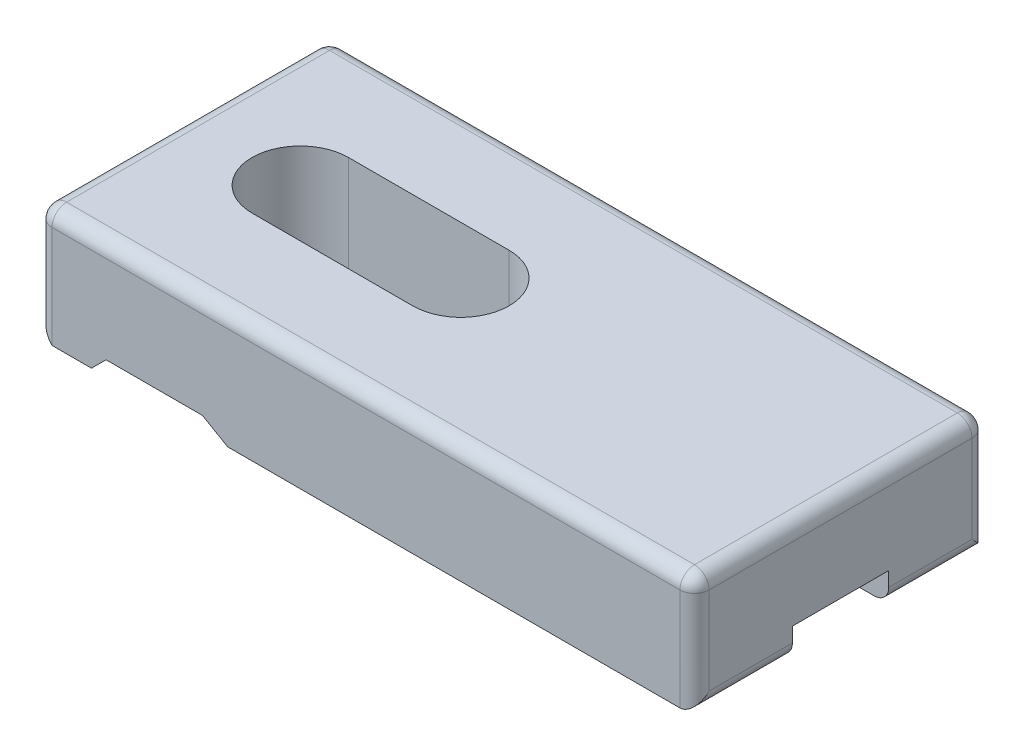
ISO-10303-21;
HEADER;
FILE_DESCRIPTION(('STEP AP214'),'2;1');
FILE_NAME('part.step','',(''),(''),'','','');
FILE_SCHEMA(('AUTOMOTIVE_DESIGN { 1 0 10303 214 1 1 1 1 }'));
ENDSEC;
DATA;
#1=APPLICATION_CONTEXT('core data for automotive mechanical design processes');
#2=APPLICATION_PROTOCOL_DEFINITION('international standard','automotive_design',2000,#1);
#3=PRODUCT_CONTEXT('',#1,'mechanical');
#4=PRODUCT('Part','Part','',(#3));
#5=PRODUCT_RELATED_PRODUCT_CATEGORY('part','',(#4));
#6=PRODUCT_DEFINITION_FORMATION('','',#4);
#7=PRODUCT_DEFINITION_CONTEXT('part definition',#1,'design');
#8=PRODUCT_DEFINITION('design','',#6,#7);
#9=PRODUCT_DEFINITION_SHAPE('','',#8);
#10=(LENGTH_UNIT() NAMED_UNIT(*) SI_UNIT(.MILLI.,.METRE.));
#11=(NAMED_UNIT(*) PLANE_ANGLE_UNIT() SI_UNIT($,.RADIAN.));
#12=(NAMED_UNIT(*) SI_UNIT($,.STERADIAN.) SOLID_ANGLE_UNIT());
#13=UNCERTAINTY_MEASURE_WITH_UNIT(LENGTH_MEASURE(1.E-05),#10,'distance_accuracy_value','');
#14=(GEOMETRIC_REPRESENTATION_CONTEXT(3) GLOBAL_UNCERTAINTY_ASSIGNED_CONTEXT((#13)) GLOBAL_UNIT_ASSIGNED_CONTEXT((#10,
#11,#12)) REPRESENTATION_CONTEXT('',''));
#15=CARTESIAN_POINT('',(0.,0.,0.));
#16=DIRECTION('',(0.,0.,1.));
#17=DIRECTION('',(1.,0.,0.));
#18=AXIS2_PLACEMENT_3D('',#15,#16,#17);
#19=CARTESIAN_POINT('',(0.,0.,0.));
#20=DIRECTION('',(0.,-1.,0.));
#21=DIRECTION('',(0.,0.,-1.));
#22=AXIS2_PLACEMENT_3D('',#19,#20,#21);
#23=PLANE('',#22);
#24=DIRECTION('',(-1.,0.,0.));
#25=VECTOR('',#24,1.);
#26=CARTESIAN_POINT('',(0.,0.,-6.7));
#27=LINE('',#26,#25);
#28=CARTESIAN_POINT('',(3.7,0.,-6.7));
#29=VERTEX_POINT('',#28);
#30=CARTESIAN_POINT('',(1.00000000000001,0.,-6.7));
#31=VERTEX_POINT('',#30);
#32=EDGE_CURVE('E268',#29,#31,#27,.T.);
#33=ORIENTED_EDGE('',*,*,#32,.F.);
#34=DIRECTION('',(0.,0.,1.));
#35=VECTOR('',#34,1.);
#36=CARTESIAN_POINT('',(3.7,0.,0.));
#37=LINE('',#36,#35);
#38=CARTESIAN_POINT('',(3.7,0.,0.));
#39=VERTEX_POINT('',#38);
#40=EDGE_CURVE('E392',#29,#39,#37,.T.);
#41=ORIENTED_EDGE('',*,*,#40,.T.);
#42=DIRECTION('',(1.,0.,0.));
#43=VECTOR('',#42,1.);
#44=CARTESIAN_POINT('',(0.,0.,0.));
#45=LINE('',#44,#43);
#46=CARTESIAN_POINT('',(1.00000000000001,0.,0.));
#47=VERTEX_POINT('',#46);
#48=EDGE_CURVE('E362',#47,#39,#45,.T.);
#49=ORIENTED_EDGE('',*,*,#48,.F.);
#50=DIRECTION('',(0.,0.,-1.));
#51=VECTOR('',#50,1.);
#52=CARTESIAN_POINT('',(1.00000000000001,0.,-6.7));
#53=LINE('',#52,#51);
#54=EDGE_CURVE('E389',#47,#31,#53,.T.);
#55=ORIENTED_EDGE('',*,*,#54,.T.);
#56=EDGE_LOOP('',(#33,#41,#49,#55));
#57=FACE_BOUND('',#56,.T.);
#58=ADVANCED_FACE('F39',(#57),#23,.T.);
#59=DIRECTION('',(-1.,0.,0.));
#60=VECTOR('',#59,1.);
#61=CARTESIAN_POINT('',(0.,0.,-20.));
#62=LINE('',#61,#60);
#63=CARTESIAN_POINT('',(44.,0.,-20.));
#64=VERTEX_POINT('',#63);
#65=CARTESIAN_POINT('',(13.0320508075689,0.,-20.));
#66=VERTEX_POINT('',#65);
#67=EDGE_CURVE('E367',#64,#66,#62,.T.);
#68=ORIENTED_EDGE('',*,*,#67,.F.);
#69=DIRECTION('',(0.,0.,-1.));
#70=VECTOR('',#69,1.);
#71=CARTESIAN_POINT('',(44.,0.,-13.3));
#72=LINE('',#71,#70);
#73=CARTESIAN_POINT('',(44.,0.,-13.3));
#74=VERTEX_POINT('',#73);
#75=EDGE_CURVE('E65',#64,#74,#72,.F.);
#76=ORIENTED_EDGE('',*,*,#75,.T.);
#77=DIRECTION('',(-1.,0.,0.));
#78=VECTOR('',#77,1.);
#79=CARTESIAN_POINT('',(19.,0.,-13.3));
#80=LINE('',#79,#78);
#81=CARTESIAN_POINT('',(13.0320508075689,0.,-13.3));
#82=VERTEX_POINT('',#81);
#83=EDGE_CURVE('E326',#74,#82,#80,.T.);
#84=ORIENTED_EDGE('',*,*,#83,.T.);
#85=DIRECTION('',(0.,0.,-1.));
#86=VECTOR('',#85,1.);
#87=CARTESIAN_POINT('',(13.0320508075689,0.,-20.));
#88=LINE('',#87,#86);
#89=EDGE_CURVE('E403',#82,#66,#88,.T.);
#90=ORIENTED_EDGE('',*,*,#89,.T.);
#91=EDGE_LOOP('',(#68,#76,#84,#90));
#92=FACE_BOUND('',#91,.T.);
#93=ADVANCED_FACE('F605',(#92),#23,.T.);
#94=DIRECTION('',(1.,0.,0.));
#95=VECTOR('',#94,1.);
#96=CARTESIAN_POINT('',(19.,0.,-6.7));
#97=LINE('',#96,#95);
#98=CARTESIAN_POINT('',(13.0320508075689,0.,-6.7));
#99=VERTEX_POINT('',#98);
#100=CARTESIAN_POINT('',(44.,0.,-6.70000000000001));
#101=VERTEX_POINT('',#100);
#102=EDGE_CURVE('E331',#99,#101,#97,.T.);
#103=ORIENTED_EDGE('',*,*,#102,.T.);
#104=DIRECTION('',(0.,0.,-1.));
#105=VECTOR('',#104,1.);
#106=CARTESIAN_POINT('',(44.,0.,0.));
#107=LINE('',#106,#105);
#108=CARTESIAN_POINT('',(44.,0.,0.));
#109=VERTEX_POINT('',#108);
#110=EDGE_CURVE('E480',#101,#109,#107,.F.);
#111=ORIENTED_EDGE('',*,*,#110,.T.);
#112=CARTESIAN_POINT('',(13.0320508075689,0.,0.));
#113=VERTEX_POINT('',#112);
#114=EDGE_CURVE('E361',#113,#109,#45,.T.);
#115=ORIENTED_EDGE('',*,*,#114,.F.);
#116=DIRECTION('',(0.,0.,-1.));
#117=VECTOR('',#116,1.);
#118=CARTESIAN_POINT('',(13.0320508075689,0.,-6.7));
#119=LINE('',#118,#117);
#120=EDGE_CURVE('E413',#113,#99,#119,.T.);
#121=ORIENTED_EDGE('',*,*,#120,.T.);
#122=EDGE_LOOP('',(#103,#111,#115,#121));
#123=FACE_BOUND('',#122,.T.);
#124=ADVANCED_FACE('F616',(#123),#23,.T.);
#125=CARTESIAN_POINT('',(8.,8.,-10.));
#126=DIRECTION('',(0.,-1.,0.));
#127=DIRECTION('',(0.,0.,-1.));
#128=AXIS2_PLACEMENT_3D('',#125,#126,#127);
#129=CYLINDRICAL_SURFACE('',#128,3.3);
#130=DIRECTION('',(0.,-1.,0.));
#131=VECTOR('',#130,1.);
#132=CARTESIAN_POINT('',(8.,8.,-6.7));
#133=LINE('',#132,#131);
#134=CARTESIAN_POINT('',(8.,8.,-6.7));
#135=VERTEX_POINT('',#134);
#136=CARTESIAN_POINT('',(8.,1.,-6.7));
#137=VERTEX_POINT('',#136);
#138=EDGE_CURVE('E349',#135,#137,#133,.T.);
#139=ORIENTED_EDGE('',*,*,#138,.T.);
#140=CARTESIAN_POINT('',(8.,1.,-10.));
#141=DIRECTION('',(0.,-1.,0.));
#142=DIRECTION('',(0.,0.,-1.));
#143=AXIS2_PLACEMENT_3D('',#140,#141,#142);
#144=CIRCLE('',#143,3.3);
#145=CARTESIAN_POINT('',(8.,1.,-13.3));
#146=VERTEX_POINT('',#145);
#147=EDGE_CURVE('E295',#137,#146,#144,.T.);
#148=ORIENTED_EDGE('',*,*,#147,.T.);
#149=DIRECTION('',(0.,-1.,0.));
#150=VECTOR('',#149,1.);
#151=CARTESIAN_POINT('',(8.,8.,-13.3));
#152=LINE('',#151,#150);
#153=CARTESIAN_POINT('',(8.,8.,-13.3));
#154=VERTEX_POINT('',#153);
#155=EDGE_CURVE('E353',#154,#146,#152,.T.);
#156=ORIENTED_EDGE('',*,*,#155,.F.);
#157=CARTESIAN_POINT('',(8.,8.,-10.));
#158=DIRECTION('',(0.,1.,0.));
#159=DIRECTION('',(0.,0.,1.));
#160=AXIS2_PLACEMENT_3D('',#157,#158,#159);
#161=CIRCLE('',#160,3.3);
#162=EDGE_CURVE('E334',#154,#135,#161,.T.);
#163=ORIENTED_EDGE('',*,*,#162,.T.);
#164=EDGE_LOOP('',(#139,#148,#156,#163));
#165=FACE_BOUND('',#164,.T.);
#166=ADVANCED_FACE('F570',(#165),#129,.F.);
#167=CARTESIAN_POINT('',(19.,8.,-10.));
#168=DIRECTION('',(0.,-1.,0.));
#169=DIRECTION('',(0.,0.,-1.));
#170=AXIS2_PLACEMENT_3D('',#167,#168,#169);
#171=CYLINDRICAL_SURFACE('',#170,3.3);
#172=DIRECTION('',(0.,-1.,0.));
#173=VECTOR('',#172,1.);
#174=CARTESIAN_POINT('',(19.,8.,-13.3));
#175=LINE('',#174,#173);
#176=CARTESIAN_POINT('',(19.,8.,-13.3));
#177=VERTEX_POINT('',#176);
#178=CARTESIAN_POINT('',(19.,2.,-13.3));
#179=VERTEX_POINT('',#178);
#180=EDGE_CURVE('E357',#177,#179,#175,.T.);
#181=ORIENTED_EDGE('',*,*,#180,.T.);
#182=CARTESIAN_POINT('',(19.,2.,-10.));
#183=DIRECTION('',(0.,-1.,0.));
#184=DIRECTION('',(0.,0.,-1.));
#185=AXIS2_PLACEMENT_3D('',#182,#183,#184);
#186=CIRCLE('',#185,3.3);
#187=CARTESIAN_POINT('',(19.,2.,-6.7));
#188=VERTEX_POINT('',#187);
#189=EDGE_CURVE('E319',#179,#188,#186,.T.);
#190=ORIENTED_EDGE('',*,*,#189,.T.);
#191=DIRECTION('',(0.,-1.,0.));
#192=VECTOR('',#191,1.);
#193=CARTESIAN_POINT('',(19.,8.,-6.7));
#194=LINE('',#193,#192);
#195=CARTESIAN_POINT('',(19.,8.,-6.7));
#196=VERTEX_POINT('',#195);
#197=EDGE_CURVE('E341',#196,#188,#194,.T.);
#198=ORIENTED_EDGE('',*,*,#197,.F.);
#199=CARTESIAN_POINT('',(19.,8.,-10.));
#200=DIRECTION('',(0.,1.,0.));
#201=DIRECTION('',(0.,0.,1.));
#202=AXIS2_PLACEMENT_3D('',#199,#200,#201);
#203=CIRCLE('',#202,3.3);
#204=EDGE_CURVE('E327',#196,#177,#203,.T.);
#205=ORIENTED_EDGE('',*,*,#204,.T.);
#206=EDGE_LOOP('',(#181,#190,#198,#205));
#207=FACE_BOUND('',#206,.T.);
#208=ADVANCED_FACE('F561',(#207),#171,.F.);
#209=CARTESIAN_POINT('',(0.,8.,0.));
#210=DIRECTION('',(0.,-1.,0.));
#211=DIRECTION('',(0.,0.,-1.));
#212=AXIS2_PLACEMENT_3D('',#209,#210,#211);
#213=PLANE('',#212);
#214=DIRECTION('',(-1.,0.,0.));
#215=VECTOR('',#214,1.);
#216=CARTESIAN_POINT('',(0.,8.,-19.));
#217=LINE('',#216,#215);
#218=CARTESIAN_POINT('',(44.,8.,-19.));
#219=VERTEX_POINT('',#218);
#220=CARTESIAN_POINT('',(1.,8.,-19.));
#221=VERTEX_POINT('',#220);
#222=EDGE_CURVE('E425',#219,#221,#217,.T.);
#223=ORIENTED_EDGE('',*,*,#222,.T.);
#224=DIRECTION('',(0.,0.,1.));
#225=VECTOR('',#224,1.);
#226=CARTESIAN_POINT('',(1.,8.,0.));
#227=LINE('',#226,#225);
#228=CARTESIAN_POINT('',(1.,8.,-1.));
#229=VERTEX_POINT('',#228);
#230=EDGE_CURVE('E428',#221,#229,#227,.T.);
#231=ORIENTED_EDGE('',*,*,#230,.T.);
#232=DIRECTION('',(1.,0.,0.));
#233=VECTOR('',#232,1.);
#234=CARTESIAN_POINT('',(0.,8.,-1.));
#235=LINE('',#234,#233);
#236=CARTESIAN_POINT('',(44.,8.,-1.));
#237=VERTEX_POINT('',#236);
#238=EDGE_CURVE('E419',#229,#237,#235,.T.);
#239=ORIENTED_EDGE('',*,*,#238,.T.);
#240=DIRECTION('',(0.,0.,-1.));
#241=VECTOR('',#240,1.);
#242=CARTESIAN_POINT('',(44.,8.,0.));
#243=LINE('',#242,#241);
#244=EDGE_CURVE('E422',#237,#219,#243,.T.);
#245=ORIENTED_EDGE('',*,*,#244,.T.);
#246=EDGE_LOOP('',(#223,#231,#239,#245));
#247=FACE_BOUND('',#246,.T.);
#248=ORIENTED_EDGE('',*,*,#204,.F.);
#249=DIRECTION('',(1.,0.,0.));
#250=VECTOR('',#249,1.);
#251=CARTESIAN_POINT('',(19.,8.,-6.7));
#252=LINE('',#251,#250);
#253=EDGE_CURVE('E338',#135,#196,#252,.T.);
#254=ORIENTED_EDGE('',*,*,#253,.F.);
#255=ORIENTED_EDGE('',*,*,#162,.F.);
#256=DIRECTION('',(-1.,0.,0.));
#257=VECTOR('',#256,1.);
#258=CARTESIAN_POINT('',(19.,8.,-13.3));
#259=LINE('',#258,#257);
#260=EDGE_CURVE('E330',#177,#154,#259,.T.);
#261=ORIENTED_EDGE('',*,*,#260,.F.);
#262=EDGE_LOOP('',(#248,#254,#255,#261));
#263=FACE_BOUND('',#262,.T.);
#264=ADVANCED_FACE('F566',(#247,#263),#213,.F.);
#265=CARTESIAN_POINT('',(3.69999999999999,0.,-20.));
#266=VERTEX_POINT('',#265);
#267=CARTESIAN_POINT('',(1.00000000000001,0.,-20.));
#268=VERTEX_POINT('',#267);
#269=EDGE_CURVE('E366',#266,#268,#62,.T.);
#270=ORIENTED_EDGE('',*,*,#269,.F.);
#271=DIRECTION('',(0.,0.,1.));
#272=VECTOR('',#271,1.);
#273=CARTESIAN_POINT('',(3.69999999999999,0.,-13.3));
#274=LINE('',#273,#272);
#275=CARTESIAN_POINT('',(3.69999999999999,0.,-13.3));
#276=VERTEX_POINT('',#275);
#277=EDGE_CURVE('E250',#266,#276,#274,.T.);
#278=ORIENTED_EDGE('',*,*,#277,.T.);
#279=DIRECTION('',(1.,0.,0.));
#280=VECTOR('',#279,1.);
#281=CARTESIAN_POINT('',(0.,0.,-13.3));
#282=LINE('',#281,#280);
#283=CARTESIAN_POINT('',(1.00000000000001,0.,-13.3));
#284=VERTEX_POINT('',#283);
#285=EDGE_CURVE('E272',#284,#276,#282,.T.);
#286=ORIENTED_EDGE('',*,*,#285,.F.);
#287=DIRECTION('',(0.,0.,-1.));
#288=VECTOR('',#287,1.);
#289=CARTESIAN_POINT('',(1.00000000000001,0.,-20.));
#290=LINE('',#289,#288);
#291=EDGE_CURVE('E244',#284,#268,#290,.T.);
#292=ORIENTED_EDGE('',*,*,#291,.T.);
#293=EDGE_LOOP('',(#270,#278,#286,#292));
#294=FACE_BOUND('',#293,.T.);
#295=ADVANCED_FACE('F613',(#294),#23,.T.);
#296=CARTESIAN_POINT('',(0.,8.,0.));
#297=DIRECTION('',(1.,0.,0.));
#298=DIRECTION('',(0.,0.,-1.));
#299=AXIS2_PLACEMENT_3D('',#296,#297,#298);
#300=PLANE('',#299);
#301=DIRECTION('',(0.,0.,1.));
#302=VECTOR('',#301,1.);
#303=CARTESIAN_POINT('',(0.,7.,0.));
#304=LINE('',#303,#302);
#305=CARTESIAN_POINT('',(0.,7.,-1.));
#306=VERTEX_POINT('',#305);
#307=CARTESIAN_POINT('',(0.,7.,-19.));
#308=VERTEX_POINT('',#307);
#309=EDGE_CURVE('E435',#306,#308,#304,.F.);
#310=ORIENTED_EDGE('',*,*,#309,.T.);
#311=DIRECTION('',(0.,-1.,0.));
#312=VECTOR('',#311,1.);
#313=CARTESIAN_POINT('',(0.,8.,-19.));
#314=LINE('',#313,#312);
#315=CARTESIAN_POINT('',(0.,1.,-19.));
#316=VERTEX_POINT('',#315);
#317=EDGE_CURVE('E232',#308,#316,#314,.T.);
#318=ORIENTED_EDGE('',*,*,#317,.T.);
#319=DIRECTION('',(0.,0.,1.));
#320=VECTOR('',#319,1.);
#321=CARTESIAN_POINT('',(0.,1.,-13.3));
#322=LINE('',#321,#320);
#323=CARTESIAN_POINT('',(0.,1.,-13.3));
#324=VERTEX_POINT('',#323);
#325=EDGE_CURVE('E223',#316,#324,#322,.T.);
#326=ORIENTED_EDGE('',*,*,#325,.T.);
#327=DIRECTION('',(0.,0.,-1.));
#328=VECTOR('',#327,1.);
#329=CARTESIAN_POINT('',(0.,1.,-6.7));
#330=LINE('',#329,#328);
#331=CARTESIAN_POINT('',(0.,1.,-6.7));
#332=VERTEX_POINT('',#331);
#333=EDGE_CURVE('E229',#332,#324,#330,.T.);
#334=ORIENTED_EDGE('',*,*,#333,.F.);
#335=DIRECTION('',(0.,0.,1.));
#336=VECTOR('',#335,1.);
#337=CARTESIAN_POINT('',(0.,1.,0.));
#338=LINE('',#337,#336);
#339=CARTESIAN_POINT('',(0.,1.,-1.));
#340=VERTEX_POINT('',#339);
#341=EDGE_CURVE('E236',#332,#340,#338,.T.);
#342=ORIENTED_EDGE('',*,*,#341,.T.);
#343=DIRECTION('',(0.,-1.,0.));
#344=VECTOR('',#343,1.);
#345=CARTESIAN_POINT('',(0.,8.,-1.));
#346=LINE('',#345,#344);
#347=EDGE_CURVE('E432',#340,#306,#346,.F.);
#348=ORIENTED_EDGE('',*,*,#347,.T.);
#349=EDGE_LOOP('',(#310,#318,#326,#334,#342,#348));
#350=FACE_BOUND('',#349,.T.);
#351=ADVANCED_FACE('F226',(#350),#300,.F.);
#352=CARTESIAN_POINT('',(0.,8.,0.));
#353=DIRECTION('',(0.,0.,-1.));
#354=DIRECTION('',(-1.,0.,0.));
#355=AXIS2_PLACEMENT_3D('',#352,#353,#354);
#356=PLANE('',#355);
#357=ORIENTED_EDGE('',*,*,#114,.T.);
#358=DIRECTION('',(0.,-1.,0.));
#359=VECTOR('',#358,1.);
#360=CARTESIAN_POINT('',(44.,8.,0.));
#361=LINE('',#360,#359);
#362=CARTESIAN_POINT('',(44.,7.,0.));
#363=VERTEX_POINT('',#362);
#364=EDGE_CURVE('E470',#109,#363,#361,.F.);
#365=ORIENTED_EDGE('',*,*,#364,.T.);
#366=DIRECTION('',(1.,0.,0.));
#367=VECTOR('',#366,1.);
#368=CARTESIAN_POINT('',(0.,7.,0.));
#369=LINE('',#368,#367);
#370=CARTESIAN_POINT('',(1.,7.,0.));
#371=VERTEX_POINT('',#370);
#372=EDGE_CURVE('E467',#363,#371,#369,.F.);
#373=ORIENTED_EDGE('',*,*,#372,.T.);
#374=DIRECTION('',(0.,-1.,0.));
#375=VECTOR('',#374,1.);
#376=CARTESIAN_POINT('',(1.,8.,0.));
#377=LINE('',#376,#375);
#378=EDGE_CURVE('E464',#371,#47,#377,.T.);
#379=ORIENTED_EDGE('',*,*,#378,.T.);
#380=ORIENTED_EDGE('',*,*,#48,.T.);
#381=DIRECTION('',(0.70710678118655,0.707106781186545,0.));
#382=VECTOR('',#381,1.);
#383=CARTESIAN_POINT('',(4.7,0.999999999999994,0.));
#384=LINE('',#383,#382);
#385=CARTESIAN_POINT('',(4.7,1.,0.));
#386=VERTEX_POINT('',#385);
#387=EDGE_CURVE('E237',#39,#386,#384,.T.);
#388=ORIENTED_EDGE('',*,*,#387,.T.);
#389=DIRECTION('',(-1.,0.,0.));
#390=VECTOR('',#389,1.);
#391=CARTESIAN_POINT('',(4.7,1.,0.));
#392=LINE('',#391,#390);
#393=CARTESIAN_POINT('',(11.3,1.,0.));
#394=VERTEX_POINT('',#393);
#395=EDGE_CURVE('E286',#394,#386,#392,.T.);
#396=ORIENTED_EDGE('',*,*,#395,.F.);
#397=DIRECTION('',(0.866025403784437,-0.500000000000003,0.));
#398=VECTOR('',#397,1.);
#399=CARTESIAN_POINT('',(11.3,1.00000000000001,0.));
#400=LINE('',#399,#398);
#401=EDGE_CURVE('E410',#394,#113,#400,.T.);
#402=ORIENTED_EDGE('',*,*,#401,.T.);
#403=EDGE_LOOP('',(#357,#365,#373,#379,#380,#388,#396,#402));
#404=FACE_BOUND('',#403,.T.);
#405=ADVANCED_FACE('F621',(#404),#356,.F.);
#406=CARTESIAN_POINT('',(45.,8.,0.));
#407=DIRECTION('',(-1.,0.,0.));
#408=DIRECTION('',(0.,0.,1.));
#409=AXIS2_PLACEMENT_3D('',#406,#407,#408);
#410=PLANE('',#409);
#411=DIRECTION('',(0.,-1.,0.));
#412=VECTOR('',#411,1.);
#413=CARTESIAN_POINT('',(45.,8.,-1.));
#414=LINE('',#413,#412);
#415=CARTESIAN_POINT('',(45.,7.,-1.));
#416=VERTEX_POINT('',#415);
#417=CARTESIAN_POINT('',(45.,1.,-1.));
#418=VERTEX_POINT('',#417);
#419=EDGE_CURVE('E458',#416,#418,#414,.T.);
#420=ORIENTED_EDGE('',*,*,#419,.T.);
#421=DIRECTION('',(0.,0.,-1.));
#422=VECTOR('',#421,1.);
#423=CARTESIAN_POINT('',(45.,1.,-6.7));
#424=LINE('',#423,#422);
#425=CARTESIAN_POINT('',(45.,1.,-6.7));
#426=VERTEX_POINT('',#425);
#427=EDGE_CURVE('E461',#418,#426,#424,.T.);
#428=ORIENTED_EDGE('',*,*,#427,.T.);
#429=DIRECTION('',(0.,-1.,0.));
#430=VECTOR('',#429,1.);
#431=CARTESIAN_POINT('',(45.,2.,-6.7));
#432=LINE('',#431,#430);
#433=CARTESIAN_POINT('',(45.,2.,-6.7));
#434=VERTEX_POINT('',#433);
#435=EDGE_CURVE('E316',#434,#426,#432,.T.);
#436=ORIENTED_EDGE('',*,*,#435,.F.);
#437=DIRECTION('',(0.,0.,1.));
#438=VECTOR('',#437,1.);
#439=CARTESIAN_POINT('',(45.,2.,-6.7));
#440=LINE('',#439,#438);
#441=CARTESIAN_POINT('',(45.,2.,-13.3));
#442=VERTEX_POINT('',#441);
#443=EDGE_CURVE('E311',#442,#434,#440,.T.);
#444=ORIENTED_EDGE('',*,*,#443,.F.);
#445=DIRECTION('',(0.,-1.,0.));
#446=VECTOR('',#445,1.);
#447=CARTESIAN_POINT('',(45.,2.,-13.3));
#448=LINE('',#447,#446);
#449=CARTESIAN_POINT('',(45.,1.,-13.3));
#450=VERTEX_POINT('',#449);
#451=EDGE_CURVE('E315',#442,#450,#448,.T.);
#452=ORIENTED_EDGE('',*,*,#451,.T.);
#453=DIRECTION('',(0.,0.,-1.));
#454=VECTOR('',#453,1.);
#455=CARTESIAN_POINT('',(45.,1.,-20.));
#456=LINE('',#455,#454);
#457=CARTESIAN_POINT('',(45.,1.,-19.));
#458=VERTEX_POINT('',#457);
#459=EDGE_CURVE('E452',#450,#458,#456,.T.);
#460=ORIENTED_EDGE('',*,*,#459,.T.);
#461=DIRECTION('',(0.,-1.,0.));
#462=VECTOR('',#461,1.);
#463=CARTESIAN_POINT('',(45.,8.,-19.));
#464=LINE('',#463,#462);
#465=CARTESIAN_POINT('',(45.,7.,-19.));
#466=VERTEX_POINT('',#465);
#467=EDGE_CURVE('E449',#458,#466,#464,.F.);
#468=ORIENTED_EDGE('',*,*,#467,.T.);
#469=DIRECTION('',(0.,0.,-1.));
#470=VECTOR('',#469,1.);
#471=CARTESIAN_POINT('',(45.,7.,0.));
#472=LINE('',#471,#470);
#473=EDGE_CURVE('E455',#466,#416,#472,.F.);
#474=ORIENTED_EDGE('',*,*,#473,.T.);
#475=EDGE_LOOP('',(#420,#428,#436,#444,#452,#460,#468,#474));
#476=FACE_BOUND('',#475,.T.);
#477=ADVANCED_FACE('F554',(#476),#410,.F.);
#478=CARTESIAN_POINT('',(0.,8.,-20.));
#479=DIRECTION('',(0.,0.,1.));
#480=DIRECTION('',(1.,0.,0.));
#481=AXIS2_PLACEMENT_3D('',#478,#479,#480);
#482=PLANE('',#481);
#483=DIRECTION('',(-1.,0.,0.));
#484=VECTOR('',#483,1.);
#485=CARTESIAN_POINT('',(0.,7.,-20.));
#486=LINE('',#485,#484);
#487=CARTESIAN_POINT('',(1.,7.,-20.));
#488=VERTEX_POINT('',#487);
#489=CARTESIAN_POINT('',(44.,7.,-20.));
#490=VERTEX_POINT('',#489);
#491=EDGE_CURVE('E443',#488,#490,#486,.F.);
#492=ORIENTED_EDGE('',*,*,#491,.T.);
#493=DIRECTION('',(0.,-1.,0.));
#494=VECTOR('',#493,1.);
#495=CARTESIAN_POINT('',(44.,8.,-20.));
#496=LINE('',#495,#494);
#497=EDGE_CURVE('E446',#490,#64,#496,.T.);
#498=ORIENTED_EDGE('',*,*,#497,.T.);
#499=ORIENTED_EDGE('',*,*,#67,.T.);
#500=DIRECTION('',(-0.866025403784437,0.500000000000003,0.));
#501=VECTOR('',#500,1.);
#502=CARTESIAN_POINT('',(11.3,1.00000000000001,-20.));
#503=LINE('',#502,#501);
#504=CARTESIAN_POINT('',(11.3,1.,-20.));
#505=VERTEX_POINT('',#504);
#506=EDGE_CURVE('E407',#66,#505,#503,.T.);
#507=ORIENTED_EDGE('',*,*,#506,.T.);
#508=DIRECTION('',(1.,0.,0.));
#509=VECTOR('',#508,1.);
#510=CARTESIAN_POINT('',(4.7,1.,-20.));
#511=LINE('',#510,#509);
#512=CARTESIAN_POINT('',(4.7,1.,-20.));
#513=VERTEX_POINT('',#512);
#514=EDGE_CURVE('E277',#513,#505,#511,.T.);
#515=ORIENTED_EDGE('',*,*,#514,.F.);
#516=DIRECTION('',(-0.70710678118655,-0.707106781186545,0.));
#517=VECTOR('',#516,1.);
#518=CARTESIAN_POINT('',(4.7,1.,-20.));
#519=LINE('',#518,#517);
#520=EDGE_CURVE('E374',#513,#266,#519,.T.);
#521=ORIENTED_EDGE('',*,*,#520,.T.);
#522=ORIENTED_EDGE('',*,*,#269,.T.);
#523=DIRECTION('',(0.,-1.,0.));
#524=VECTOR('',#523,1.);
#525=CARTESIAN_POINT('',(1.,8.,-20.));
#526=LINE('',#525,#524);
#527=EDGE_CURVE('E440',#268,#488,#526,.F.);
#528=ORIENTED_EDGE('',*,*,#527,.T.);
#529=EDGE_LOOP('',(#492,#498,#499,#507,#515,#521,#522,#528));
#530=FACE_BOUND('',#529,.T.);
#531=ADVANCED_FACE('F588',(#530),#482,.F.);
#532=CARTESIAN_POINT('',(19.,8.,-13.3));
#533=DIRECTION('',(0.,0.,1.));
#534=DIRECTION('',(1.,0.,0.));
#535=AXIS2_PLACEMENT_3D('',#532,#533,#534);
#536=PLANE('',#535);
#537=ORIENTED_EDGE('',*,*,#83,.F.);
#538=CARTESIAN_POINT('',(44.,1.,-13.3));
#539=DIRECTION('',(0.,0.,1.));
#540=DIRECTION('',(1.,0.,0.));
#541=AXIS2_PLACEMENT_3D('',#538,#539,#540);
#542=CIRCLE('',#541,1.);
#543=EDGE_CURVE('E475',#74,#450,#542,.T.);
#544=ORIENTED_EDGE('',*,*,#543,.T.);
#545=ORIENTED_EDGE('',*,*,#451,.F.);
#546=DIRECTION('',(1.,0.,0.));
#547=VECTOR('',#546,1.);
#548=CARTESIAN_POINT('',(45.,2.,-13.3));
#549=LINE('',#548,#547);
#550=EDGE_CURVE('E308',#179,#442,#549,.T.);
#551=ORIENTED_EDGE('',*,*,#550,.F.);
#552=ORIENTED_EDGE('',*,*,#180,.F.);
#553=ORIENTED_EDGE('',*,*,#260,.T.);
#554=ORIENTED_EDGE('',*,*,#155,.T.);
#555=DIRECTION('',(1.,0.,0.));
#556=VECTOR('',#555,1.);
#557=CARTESIAN_POINT('',(19.,1.,-13.3));
#558=LINE('',#557,#556);
#559=CARTESIAN_POINT('',(11.3,1.,-13.3));
#560=VERTEX_POINT('',#559);
#561=EDGE_CURVE('E301',#146,#560,#558,.T.);
#562=ORIENTED_EDGE('',*,*,#561,.T.);
#563=DIRECTION('',(0.866025403784437,-0.500000000000003,0.));
#564=VECTOR('',#563,1.);
#565=CARTESIAN_POINT('',(14.0439110867544,-0.584197804570075,-13.3));
#566=LINE('',#565,#564);
#567=EDGE_CURVE('E399',#560,#82,#566,.T.);
#568=ORIENTED_EDGE('',*,*,#567,.T.);
#569=EDGE_LOOP('',(#537,#544,#545,#551,#552,#553,#554,#562,#568));
#570=FACE_BOUND('',#569,.T.);
#571=ADVANCED_FACE('F550',(#570),#536,.T.);
#572=CARTESIAN_POINT('',(19.,8.,-6.7));
#573=DIRECTION('',(0.,0.,-1.));
#574=DIRECTION('',(-1.,0.,0.));
#575=AXIS2_PLACEMENT_3D('',#572,#573,#574);
#576=PLANE('',#575);
#577=ORIENTED_EDGE('',*,*,#435,.T.);
#578=CARTESIAN_POINT('',(44.,1.,-6.70000000000001));
#579=DIRECTION('',(0.,0.,-1.));
#580=DIRECTION('',(-1.,0.,0.));
#581=AXIS2_PLACEMENT_3D('',#578,#579,#580);
#582=CIRCLE('',#581,1.);
#583=EDGE_CURVE('E57',#426,#101,#582,.T.);
#584=ORIENTED_EDGE('',*,*,#583,.T.);
#585=ORIENTED_EDGE('',*,*,#102,.F.);
#586=DIRECTION('',(-0.866025403784437,0.500000000000003,0.));
#587=VECTOR('',#586,1.);
#588=CARTESIAN_POINT('',(14.0439110867544,-0.584197804570075,-6.7));
#589=LINE('',#588,#587);
#590=CARTESIAN_POINT('',(11.3,1.,-6.7));
#591=VERTEX_POINT('',#590);
#592=EDGE_CURVE('E416',#99,#591,#589,.T.);
#593=ORIENTED_EDGE('',*,*,#592,.T.);
#594=DIRECTION('',(-1.,0.,0.));
#595=VECTOR('',#594,1.);
#596=CARTESIAN_POINT('',(19.,1.,-6.7));
#597=LINE('',#596,#595);
#598=EDGE_CURVE('E370',#591,#137,#597,.T.);
#599=ORIENTED_EDGE('',*,*,#598,.T.);
#600=ORIENTED_EDGE('',*,*,#138,.F.);
#601=ORIENTED_EDGE('',*,*,#253,.T.);
#602=ORIENTED_EDGE('',*,*,#197,.T.);
#603=DIRECTION('',(-1.,0.,0.));
#604=VECTOR('',#603,1.);
#605=CARTESIAN_POINT('',(8.,2.,-6.7));
#606=LINE('',#605,#604);
#607=EDGE_CURVE('E305',#434,#188,#606,.T.);
#608=ORIENTED_EDGE('',*,*,#607,.F.);
#609=EDGE_LOOP('',(#577,#584,#585,#593,#599,#600,#601,#602,#608));
#610=FACE_BOUND('',#609,.T.);
#611=ADVANCED_FACE('F574',(#610),#576,.T.);
#612=CARTESIAN_POINT('',(8.,2.,-10.));
#613=DIRECTION('',(0.,-1.,0.));
#614=DIRECTION('',(0.,0.,-1.));
#615=AXIS2_PLACEMENT_3D('',#612,#613,#614);
#616=PLANE('',#615);
#617=ORIENTED_EDGE('',*,*,#550,.T.);
#618=ORIENTED_EDGE('',*,*,#443,.T.);
#619=ORIENTED_EDGE('',*,*,#607,.T.);
#620=ORIENTED_EDGE('',*,*,#189,.F.);
#621=EDGE_LOOP('',(#617,#618,#619,#620));
#622=FACE_BOUND('',#621,.T.);
#623=ADVANCED_FACE('F557',(#622),#616,.T.);
#624=CARTESIAN_POINT('',(0.,1.,-6.7));
#625=DIRECTION('',(0.,0.,1.));
#626=DIRECTION('',(1.,0.,0.));
#627=AXIS2_PLACEMENT_3D('',#624,#625,#626);
#628=PLANE('',#627);
#629=DIRECTION('',(-1.,0.,0.));
#630=VECTOR('',#629,1.);
#631=CARTESIAN_POINT('',(0.,1.,-6.7));
#632=LINE('',#631,#630);
#633=CARTESIAN_POINT('',(4.7,1.,-6.7));
#634=VERTEX_POINT('',#633);
#635=EDGE_CURVE('E266',#634,#332,#632,.T.);
#636=ORIENTED_EDGE('',*,*,#635,.F.);
#637=DIRECTION('',(-0.70710678118655,-0.707106781186545,0.));
#638=VECTOR('',#637,1.);
#639=CARTESIAN_POINT('',(4.7,0.999999999999994,-6.7));
#640=LINE('',#639,#638);
#641=EDGE_CURVE('E386',#634,#29,#640,.T.);
#642=ORIENTED_EDGE('',*,*,#641,.T.);
#643=ORIENTED_EDGE('',*,*,#32,.T.);
#644=DIRECTION('',(-0.70710678118655,0.707106781186545,0.));
#645=VECTOR('',#644,1.);
#646=CARTESIAN_POINT('',(0.,1.,-6.7));
#647=LINE('',#646,#645);
#648=EDGE_CURVE('E383',#31,#332,#647,.T.);
#649=ORIENTED_EDGE('',*,*,#648,.T.);
#650=EDGE_LOOP('',(#636,#642,#643,#649));
#651=FACE_BOUND('',#650,.T.);
#652=ADVANCED_FACE('F653',(#651),#628,.F.);
#653=CARTESIAN_POINT('',(0.,1.,-13.3));
#654=DIRECTION('',(0.,0.,-1.));
#655=DIRECTION('',(-1.,0.,0.));
#656=AXIS2_PLACEMENT_3D('',#653,#654,#655);
#657=PLANE('',#656);
#658=ORIENTED_EDGE('',*,*,#285,.T.);
#659=DIRECTION('',(0.70710678118655,0.707106781186545,0.));
#660=VECTOR('',#659,1.);
#661=CARTESIAN_POINT('',(4.7,1.,-13.3));
#662=LINE('',#661,#660);
#663=CARTESIAN_POINT('',(4.7,1.,-13.3));
#664=VERTEX_POINT('',#663);
#665=EDGE_CURVE('E249',#276,#664,#662,.T.);
#666=ORIENTED_EDGE('',*,*,#665,.T.);
#667=DIRECTION('',(1.,0.,0.));
#668=VECTOR('',#667,1.);
#669=CARTESIAN_POINT('',(0.,1.,-13.3));
#670=LINE('',#669,#668);
#671=EDGE_CURVE('E253',#324,#664,#670,.T.);
#672=ORIENTED_EDGE('',*,*,#671,.F.);
#673=DIRECTION('',(0.70710678118655,-0.707106781186545,0.));
#674=VECTOR('',#673,1.);
#675=CARTESIAN_POINT('',(0.,1.,-13.3));
#676=LINE('',#675,#674);
#677=EDGE_CURVE('E240',#324,#284,#676,.T.);
#678=ORIENTED_EDGE('',*,*,#677,.T.);
#679=EDGE_LOOP('',(#658,#666,#672,#678));
#680=FACE_BOUND('',#679,.T.);
#681=ADVANCED_FACE('F254',(#680),#657,.F.);
#682=CARTESIAN_POINT('',(0.,1.,0.));
#683=DIRECTION('',(0.,-1.,0.));
#684=DIRECTION('',(0.,0.,-1.));
#685=AXIS2_PLACEMENT_3D('',#682,#683,#684);
#686=PLANE('',#685);
#687=ORIENTED_EDGE('',*,*,#147,.F.);
#688=ORIENTED_EDGE('',*,*,#598,.F.);
#689=DIRECTION('',(0.,0.,1.));
#690=VECTOR('',#689,1.);
#691=CARTESIAN_POINT('',(11.3,1.,0.));
#692=LINE('',#691,#690);
#693=EDGE_CURVE('E281',#591,#394,#692,.T.);
#694=ORIENTED_EDGE('',*,*,#693,.T.);
#695=ORIENTED_EDGE('',*,*,#395,.T.);
#696=DIRECTION('',(0.,0.,-1.));
#697=VECTOR('',#696,1.);
#698=CARTESIAN_POINT('',(4.7,1.,0.));
#699=LINE('',#698,#697);
#700=EDGE_CURVE('E290',#386,#634,#699,.T.);
#701=ORIENTED_EDGE('',*,*,#700,.T.);
#702=ORIENTED_EDGE('',*,*,#635,.T.);
#703=ORIENTED_EDGE('',*,*,#333,.T.);
#704=ORIENTED_EDGE('',*,*,#671,.T.);
#705=DIRECTION('',(0.,0.,-1.));
#706=VECTOR('',#705,1.);
#707=CARTESIAN_POINT('',(4.7,1.,-13.3));
#708=LINE('',#707,#706);
#709=EDGE_CURVE('E260',#664,#513,#708,.T.);
#710=ORIENTED_EDGE('',*,*,#709,.T.);
#711=ORIENTED_EDGE('',*,*,#514,.T.);
#712=EDGE_CURVE('E282',#505,#560,#692,.T.);
#713=ORIENTED_EDGE('',*,*,#712,.T.);
#714=ORIENTED_EDGE('',*,*,#561,.F.);
#715=EDGE_LOOP('',(#687,#688,#694,#695,#701,#702,#703,#704,#710,#711,#713,#714));
#716=FACE_BOUND('',#715,.T.);
#717=ADVANCED_FACE('F263',(#716),#686,.T.);
#718=CARTESIAN_POINT('',(4.7,1.,-13.3));
#719=DIRECTION('',(0.707106781186545,-0.70710678118655,0.));
#720=DIRECTION('',(0.,0.,1.));
#721=AXIS2_PLACEMENT_3D('',#718,#719,#720);
#722=PLANE('',#721);
#723=ORIENTED_EDGE('',*,*,#665,.F.);
#724=ORIENTED_EDGE('',*,*,#277,.F.);
#725=ORIENTED_EDGE('',*,*,#520,.F.);
#726=ORIENTED_EDGE('',*,*,#709,.F.);
#727=EDGE_LOOP('',(#723,#724,#725,#726));
#728=FACE_BOUND('',#727,.T.);
#729=ADVANCED_FACE('F612',(#728),#722,.T.);
#730=CARTESIAN_POINT('',(4.7,0.999999999999994,0.));
#731=DIRECTION('',(0.707106781186545,-0.70710678118655,0.));
#732=DIRECTION('',(0.,0.,1.));
#733=AXIS2_PLACEMENT_3D('',#730,#731,#732);
#734=PLANE('',#733);
#735=ORIENTED_EDGE('',*,*,#387,.F.);
#736=ORIENTED_EDGE('',*,*,#40,.F.);
#737=ORIENTED_EDGE('',*,*,#641,.F.);
#738=ORIENTED_EDGE('',*,*,#700,.F.);
#739=EDGE_LOOP('',(#735,#736,#737,#738));
#740=FACE_BOUND('',#739,.T.);
#741=ADVANCED_FACE('F649',(#740),#734,.T.);
#742=CARTESIAN_POINT('',(0.,1.,0.));
#743=DIRECTION('',(-0.707106781186545,-0.70710678118655,0.));
#744=DIRECTION('',(0.,0.,-1.));
#745=AXIS2_PLACEMENT_3D('',#742,#743,#744);
#746=PLANE('',#745);
#747=ORIENTED_EDGE('',*,*,#54,.F.);
#748=CARTESIAN_POINT('',(1.,0.,-1.));
#749=DIRECTION('',(-0.707106781186545,-0.70710678118655,0.));
#750=DIRECTION('',(0.70710678118655,-0.707106781186545,0.));
#751=AXIS2_PLACEMENT_3D('',#748,#749,#750);
#752=ELLIPSE('',#751,1.41421356237309,1.);
#753=EDGE_CURVE('E11',#47,#340,#752,.T.);
#754=ORIENTED_EDGE('',*,*,#753,.T.);
#755=ORIENTED_EDGE('',*,*,#341,.F.);
#756=ORIENTED_EDGE('',*,*,#648,.F.);
#757=EDGE_LOOP('',(#747,#754,#755,#756));
#758=FACE_BOUND('',#757,.T.);
#759=ADVANCED_FACE('F659',(#758),#746,.T.);
#760=CARTESIAN_POINT('',(0.,1.,0.));
#761=DIRECTION('',(-0.707106781186545,-0.70710678118655,0.));
#762=DIRECTION('',(0.,0.,-1.));
#763=AXIS2_PLACEMENT_3D('',#760,#761,#762);
#764=PLANE('',#763);
#765=ORIENTED_EDGE('',*,*,#325,.F.);
#766=CARTESIAN_POINT('',(1.,0.,-19.));
#767=DIRECTION('',(-0.707106781186545,-0.70710678118655,0.));
#768=DIRECTION('',(0.70710678118655,-0.707106781186545,0.));
#769=AXIS2_PLACEMENT_3D('',#766,#767,#768);
#770=ELLIPSE('',#769,1.41421356237309,1.);
#771=EDGE_CURVE('E49',#316,#268,#770,.T.);
#772=ORIENTED_EDGE('',*,*,#771,.T.);
#773=ORIENTED_EDGE('',*,*,#291,.F.);
#774=ORIENTED_EDGE('',*,*,#677,.F.);
#775=EDGE_LOOP('',(#765,#772,#773,#774));
#776=FACE_BOUND('',#775,.T.);
#777=ADVANCED_FACE('F242',(#776),#764,.T.);
#778=CARTESIAN_POINT('',(11.3,1.00000000000001,0.));
#779=DIRECTION('',(-0.500000000000003,-0.866025403784437,0.));
#780=DIRECTION('',(0.,0.,-1.));
#781=AXIS2_PLACEMENT_3D('',#778,#779,#780);
#782=PLANE('',#781);
#783=ORIENTED_EDGE('',*,*,#506,.F.);
#784=ORIENTED_EDGE('',*,*,#89,.F.);
#785=ORIENTED_EDGE('',*,*,#567,.F.);
#786=ORIENTED_EDGE('',*,*,#712,.F.);
#787=EDGE_LOOP('',(#783,#784,#785,#786));
#788=FACE_BOUND('',#787,.T.);
#789=ADVANCED_FACE('F610',(#788),#782,.T.);
#790=CARTESIAN_POINT('',(11.3,1.00000000000001,0.));
#791=DIRECTION('',(-0.500000000000003,-0.866025403784437,0.));
#792=DIRECTION('',(0.,0.,-1.));
#793=AXIS2_PLACEMENT_3D('',#790,#791,#792);
#794=PLANE('',#793);
#795=ORIENTED_EDGE('',*,*,#592,.F.);
#796=ORIENTED_EDGE('',*,*,#120,.F.);
#797=ORIENTED_EDGE('',*,*,#401,.F.);
#798=ORIENTED_EDGE('',*,*,#693,.F.);
#799=EDGE_LOOP('',(#795,#796,#797,#798));
#800=FACE_BOUND('',#799,.T.);
#801=ADVANCED_FACE('F578',(#800),#794,.T.);
#802=CARTESIAN_POINT('',(44.,1.,0.));
#803=DIRECTION('',(0.,0.,1.));
#804=DIRECTION('',(1.,0.,0.));
#805=AXIS2_PLACEMENT_3D('',#802,#803,#804);
#806=CYLINDRICAL_SURFACE('',#805,1.);
#807=ORIENTED_EDGE('',*,*,#543,.F.);
#808=ORIENTED_EDGE('',*,*,#75,.F.);
#809=CARTESIAN_POINT('',(44.,1.,-19.));
#810=DIRECTION('',(0.,-0.707106781186547,0.707106781186547));
#811=DIRECTION('',(0.,-0.707106781186547,-0.707106781186547));
#812=AXIS2_PLACEMENT_3D('',#809,#810,#811);
#813=ELLIPSE('',#812,1.41421356237309,1.);
#814=EDGE_CURVE('E43',#458,#64,#813,.F.);
#815=ORIENTED_EDGE('',*,*,#814,.F.);
#816=ORIENTED_EDGE('',*,*,#459,.F.);
#817=EDGE_LOOP('',(#807,#808,#815,#816));
#818=FACE_BOUND('',#817,.T.);
#819=ADVANCED_FACE('F41',(#818),#806,.T.);
#820=CARTESIAN_POINT('',(44.,1.,0.));
#821=DIRECTION('',(0.,0.,1.));
#822=DIRECTION('',(1.,0.,0.));
#823=AXIS2_PLACEMENT_3D('',#820,#821,#822);
#824=CYLINDRICAL_SURFACE('',#823,1.);
#825=ORIENTED_EDGE('',*,*,#583,.F.);
#826=ORIENTED_EDGE('',*,*,#427,.F.);
#827=CARTESIAN_POINT('',(44.,1.,-1.));
#828=DIRECTION('',(0.,-0.707106781186547,-0.707106781186547));
#829=DIRECTION('',(0.,-0.707106781186547,0.707106781186547));
#830=AXIS2_PLACEMENT_3D('',#827,#828,#829);
#831=ELLIPSE('',#830,1.41421356237309,1.);
#832=EDGE_CURVE('E530',#109,#418,#831,.F.);
#833=ORIENTED_EDGE('',*,*,#832,.F.);
#834=ORIENTED_EDGE('',*,*,#110,.F.);
#835=EDGE_LOOP('',(#825,#826,#833,#834));
#836=FACE_BOUND('',#835,.T.);
#837=ADVANCED_FACE('F638',(#836),#824,.T.);
#838=CARTESIAN_POINT('',(44.,8.,-19.));
#839=DIRECTION('',(0.,-1.,0.));
#840=DIRECTION('',(0.,0.,-1.));
#841=AXIS2_PLACEMENT_3D('',#838,#839,#840);
#842=CYLINDRICAL_SURFACE('',#841,1.);
#843=ORIENTED_EDGE('',*,*,#814,.T.);
#844=ORIENTED_EDGE('',*,*,#497,.F.);
#845=CARTESIAN_POINT('',(44.,7.,-19.));
#846=DIRECTION('',(0.,1.,0.));
#847=DIRECTION('',(0.,0.,1.));
#848=AXIS2_PLACEMENT_3D('',#845,#846,#847);
#849=CIRCLE('',#848,1.);
#850=EDGE_CURVE('E527',#466,#490,#849,.T.);
#851=ORIENTED_EDGE('',*,*,#850,.F.);
#852=ORIENTED_EDGE('',*,*,#467,.F.);
#853=EDGE_LOOP('',(#843,#844,#851,#852));
#854=FACE_BOUND('',#853,.T.);
#855=ADVANCED_FACE('F543',(#854),#842,.T.);
#856=CARTESIAN_POINT('',(44.,7.,0.));
#857=DIRECTION('',(0.,0.,-1.));
#858=DIRECTION('',(-1.,0.,0.));
#859=AXIS2_PLACEMENT_3D('',#856,#857,#858);
#860=CYLINDRICAL_SURFACE('',#859,1.);
#861=CARTESIAN_POINT('',(44.,7.,-1.));
#862=DIRECTION('',(0.,0.,1.));
#863=DIRECTION('',(1.,0.,0.));
#864=AXIS2_PLACEMENT_3D('',#861,#862,#863);
#865=CIRCLE('',#864,1.);
#866=EDGE_CURVE('E519',#416,#237,#865,.T.);
#867=ORIENTED_EDGE('',*,*,#866,.F.);
#868=ORIENTED_EDGE('',*,*,#473,.F.);
#869=CARTESIAN_POINT('',(44.,7.,-19.));
#870=DIRECTION('',(0.,0.,-1.));
#871=DIRECTION('',(-1.,0.,0.));
#872=AXIS2_PLACEMENT_3D('',#869,#870,#871);
#873=CIRCLE('',#872,1.);
#874=EDGE_CURVE('E523',#219,#466,#873,.T.);
#875=ORIENTED_EDGE('',*,*,#874,.F.);
#876=ORIENTED_EDGE('',*,*,#244,.F.);
#877=EDGE_LOOP('',(#867,#868,#875,#876));
#878=FACE_BOUND('',#877,.T.);
#879=ADVANCED_FACE('F679',(#878),#860,.T.);
#880=CARTESIAN_POINT('',(44.,8.,-1.));
#881=DIRECTION('',(0.,-1.,0.));
#882=DIRECTION('',(0.,0.,-1.));
#883=AXIS2_PLACEMENT_3D('',#880,#881,#882);
#884=CYLINDRICAL_SURFACE('',#883,1.);
#885=ORIENTED_EDGE('',*,*,#832,.T.);
#886=ORIENTED_EDGE('',*,*,#419,.F.);
#887=CARTESIAN_POINT('',(44.,7.,-1.));
#888=DIRECTION('',(0.,1.,0.));
#889=DIRECTION('',(0.,0.,1.));
#890=AXIS2_PLACEMENT_3D('',#887,#888,#889);
#891=CIRCLE('',#890,1.);
#892=EDGE_CURVE('E515',#363,#416,#891,.T.);
#893=ORIENTED_EDGE('',*,*,#892,.F.);
#894=ORIENTED_EDGE('',*,*,#364,.F.);
#895=EDGE_LOOP('',(#885,#886,#893,#894));
#896=FACE_BOUND('',#895,.T.);
#897=ADVANCED_FACE('F641',(#896),#884,.T.);
#898=CARTESIAN_POINT('',(44.,7.,-19.));
#899=DIRECTION('',(0.,0.,1.));
#900=DIRECTION('',(1.,0.,0.));
#901=AXIS2_PLACEMENT_3D('',#898,#899,#900);
#902=SPHERICAL_SURFACE('',#901,1.);
#903=ORIENTED_EDGE('',*,*,#874,.T.);
#904=ORIENTED_EDGE('',*,*,#850,.T.);
#905=CARTESIAN_POINT('',(44.,7.,-19.));
#906=DIRECTION('',(1.,0.,0.));
#907=DIRECTION('',(0.,0.,-1.));
#908=AXIS2_PLACEMENT_3D('',#905,#906,#907);
#909=CIRCLE('',#908,1.);
#910=EDGE_CURVE('E511',#219,#490,#909,.F.);
#911=ORIENTED_EDGE('',*,*,#910,.F.);
#912=EDGE_LOOP('',(#903,#904,#911));
#913=FACE_BOUND('',#912,.T.);
#914=ADVANCED_FACE('F681',(#913),#902,.T.);
#915=CARTESIAN_POINT('',(44.,7.,-1.));
#916=DIRECTION('',(0.,0.,1.));
#917=DIRECTION('',(1.,0.,0.));
#918=AXIS2_PLACEMENT_3D('',#915,#916,#917);
#919=SPHERICAL_SURFACE('',#918,1.);
#920=ORIENTED_EDGE('',*,*,#892,.T.);
#921=ORIENTED_EDGE('',*,*,#866,.T.);
#922=CARTESIAN_POINT('',(44.,7.,-1.));
#923=DIRECTION('',(1.,0.,0.));
#924=DIRECTION('',(0.,0.,-1.));
#925=AXIS2_PLACEMENT_3D('',#922,#923,#924);
#926=CIRCLE('',#925,1.);
#927=EDGE_CURVE('E507',#363,#237,#926,.F.);
#928=ORIENTED_EDGE('',*,*,#927,.F.);
#929=EDGE_LOOP('',(#920,#921,#928));
#930=FACE_BOUND('',#929,.T.);
#931=ADVANCED_FACE('F683',(#930),#919,.T.);
#932=CARTESIAN_POINT('',(1.,8.,-19.));
#933=DIRECTION('',(0.,-1.,0.));
#934=DIRECTION('',(0.,0.,-1.));
#935=AXIS2_PLACEMENT_3D('',#932,#933,#934);
#936=CYLINDRICAL_SURFACE('',#935,1.);
#937=ORIENTED_EDGE('',*,*,#771,.F.);
#938=ORIENTED_EDGE('',*,*,#317,.F.);
#939=CARTESIAN_POINT('',(1.,7.,-19.));
#940=DIRECTION('',(0.,1.,0.));
#941=DIRECTION('',(0.,0.,1.));
#942=AXIS2_PLACEMENT_3D('',#939,#940,#941);
#943=CIRCLE('',#942,1.);
#944=EDGE_CURVE('E503',#488,#308,#943,.T.);
#945=ORIENTED_EDGE('',*,*,#944,.F.);
#946=ORIENTED_EDGE('',*,*,#527,.F.);
#947=EDGE_LOOP('',(#937,#938,#945,#946));
#948=FACE_BOUND('',#947,.T.);
#949=ADVANCED_FACE('F595',(#948),#936,.T.);
#950=CARTESIAN_POINT('',(0.,7.,-19.));
#951=DIRECTION('',(-1.,0.,0.));
#952=DIRECTION('',(0.,0.,1.));
#953=AXIS2_PLACEMENT_3D('',#950,#951,#952);
#954=CYLINDRICAL_SURFACE('',#953,1.);
#955=ORIENTED_EDGE('',*,*,#910,.T.);
#956=ORIENTED_EDGE('',*,*,#491,.F.);
#957=CARTESIAN_POINT('',(1.,7.,-19.));
#958=DIRECTION('',(-1.,0.,0.));
#959=DIRECTION('',(0.,0.,1.));
#960=AXIS2_PLACEMENT_3D('',#957,#958,#959);
#961=CIRCLE('',#960,1.);
#962=EDGE_CURVE('E499',#221,#488,#961,.T.);
#963=ORIENTED_EDGE('',*,*,#962,.F.);
#964=ORIENTED_EDGE('',*,*,#222,.F.);
#965=EDGE_LOOP('',(#955,#956,#963,#964));
#966=FACE_BOUND('',#965,.T.);
#967=ADVANCED_FACE('F603',(#966),#954,.T.);
#968=CARTESIAN_POINT('',(0.,7.,-1.));
#969=DIRECTION('',(1.,0.,0.));
#970=DIRECTION('',(0.,0.,-1.));
#971=AXIS2_PLACEMENT_3D('',#968,#969,#970);
#972=CYLINDRICAL_SURFACE('',#971,1.);
#973=ORIENTED_EDGE('',*,*,#927,.T.);
#974=ORIENTED_EDGE('',*,*,#238,.F.);
#975=CARTESIAN_POINT('',(1.,7.,-1.));
#976=DIRECTION('',(-1.,0.,0.));
#977=DIRECTION('',(0.,0.,1.));
#978=AXIS2_PLACEMENT_3D('',#975,#976,#977);
#979=CIRCLE('',#978,1.);
#980=EDGE_CURVE('E495',#371,#229,#979,.T.);
#981=ORIENTED_EDGE('',*,*,#980,.F.);
#982=ORIENTED_EDGE('',*,*,#372,.F.);
#983=EDGE_LOOP('',(#973,#974,#981,#982));
#984=FACE_BOUND('',#983,.T.);
#985=ADVANCED_FACE('F673',(#984),#972,.T.);
#986=CARTESIAN_POINT('',(1.,8.,-1.));
#987=DIRECTION('',(0.,-1.,0.));
#988=DIRECTION('',(0.,0.,-1.));
#989=AXIS2_PLACEMENT_3D('',#986,#987,#988);
#990=CYLINDRICAL_SURFACE('',#989,1.);
#991=ORIENTED_EDGE('',*,*,#753,.F.);
#992=ORIENTED_EDGE('',*,*,#378,.F.);
#993=CARTESIAN_POINT('',(1.,7.,-1.));
#994=DIRECTION('',(0.,1.,0.));
#995=DIRECTION('',(0.,0.,1.));
#996=AXIS2_PLACEMENT_3D('',#993,#994,#995);
#997=CIRCLE('',#996,1.);
#998=EDGE_CURVE('E491',#306,#371,#997,.T.);
#999=ORIENTED_EDGE('',*,*,#998,.F.);
#1000=ORIENTED_EDGE('',*,*,#347,.F.);
#1001=EDGE_LOOP('',(#991,#992,#999,#1000));
#1002=FACE_BOUND('',#1001,.T.);
#1003=ADVANCED_FACE('F662',(#1002),#990,.T.);
#1004=CARTESIAN_POINT('',(1.,7.,-19.));
#1005=DIRECTION('',(0.,0.,1.));
#1006=DIRECTION('',(1.,0.,0.));
#1007=AXIS2_PLACEMENT_3D('',#1004,#1005,#1006);
#1008=SPHERICAL_SURFACE('',#1007,1.);
#1009=ORIENTED_EDGE('',*,*,#962,.T.);
#1010=ORIENTED_EDGE('',*,*,#944,.T.);
#1011=CARTESIAN_POINT('',(1.,7.,-19.));
#1012=DIRECTION('',(0.,0.,-1.));
#1013=DIRECTION('',(-1.,0.,0.));
#1014=AXIS2_PLACEMENT_3D('',#1011,#1012,#1013);
#1015=CIRCLE('',#1014,1.);
#1016=EDGE_CURVE('E488',#221,#308,#1015,.F.);
#1017=ORIENTED_EDGE('',*,*,#1016,.F.);
#1018=EDGE_LOOP('',(#1009,#1010,#1017));
#1019=FACE_BOUND('',#1018,.T.);
#1020=ADVANCED_FACE('F599',(#1019),#1008,.T.);
#1021=CARTESIAN_POINT('',(1.,7.,-1.));
#1022=DIRECTION('',(0.,0.,1.));
#1023=DIRECTION('',(1.,0.,0.));
#1024=AXIS2_PLACEMENT_3D('',#1021,#1022,#1023);
#1025=SPHERICAL_SURFACE('',#1024,1.);
#1026=ORIENTED_EDGE('',*,*,#998,.T.);
#1027=ORIENTED_EDGE('',*,*,#980,.T.);
#1028=CARTESIAN_POINT('',(1.,7.,-1.));
#1029=DIRECTION('',(0.,0.,1.));
#1030=DIRECTION('',(1.,0.,0.));
#1031=AXIS2_PLACEMENT_3D('',#1028,#1029,#1030);
#1032=CIRCLE('',#1031,1.);
#1033=EDGE_CURVE('E485',#306,#229,#1032,.F.);
#1034=ORIENTED_EDGE('',*,*,#1033,.F.);
#1035=EDGE_LOOP('',(#1026,#1027,#1034));
#1036=FACE_BOUND('',#1035,.T.);
#1037=ADVANCED_FACE('F670',(#1036),#1025,.T.);
#1038=CARTESIAN_POINT('',(1.,7.,0.));
#1039=DIRECTION('',(0.,0.,1.));
#1040=DIRECTION('',(1.,0.,0.));
#1041=AXIS2_PLACEMENT_3D('',#1038,#1039,#1040);
#1042=CYLINDRICAL_SURFACE('',#1041,1.);
#1043=ORIENTED_EDGE('',*,*,#1016,.T.);
#1044=ORIENTED_EDGE('',*,*,#309,.F.);
#1045=ORIENTED_EDGE('',*,*,#1033,.T.);
#1046=ORIENTED_EDGE('',*,*,#230,.F.);
#1047=EDGE_LOOP('',(#1043,#1044,#1045,#1046));
#1048=FACE_BOUND('',#1047,.T.);
#1049=ADVANCED_FACE('F668',(#1048),#1042,.T.);
#1050=CLOSED_SHELL('',(#58,#93,#124,#166,#208,#264,#295,#351,#405,#477,#531,#571,#611,#623,#652,
#681,#717,#729,#741,#759,#777,#789,#801,#819,#837,#855,#879,#897,#914,#931,#949,#967,#985,#1003,
#1020,#1037,#1049));
#1051=MANIFOLD_SOLID_BREP('B2',#1050);
#1052=ADVANCED_BREP_SHAPE_REPRESENTATION('',(#18,#1051),#14);
#1053=SHAPE_DEFINITION_REPRESENTATION(#9,#1052);
ENDSEC;
END-ISO-10303-21;
